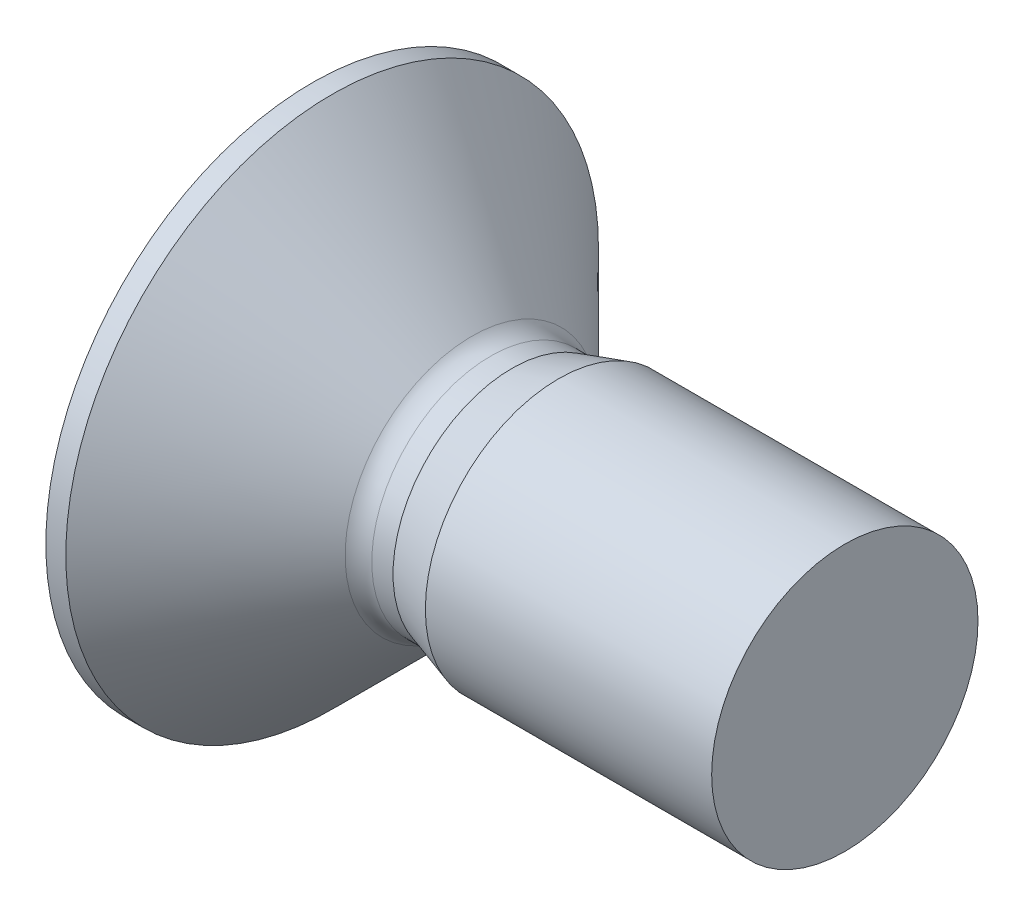
ISO-10303-21;
HEADER;
FILE_DESCRIPTION(('STEP AP214'),'2;1');
FILE_NAME('part.step','',(''),(''),'','','');
FILE_SCHEMA(('AUTOMOTIVE_DESIGN { 1 0 10303 214 1 1 1 1 }'));
ENDSEC;
DATA;
#1=APPLICATION_CONTEXT('core data for automotive mechanical design processes');
#2=APPLICATION_PROTOCOL_DEFINITION('international standard','automotive_design',2000,#1);
#3=PRODUCT_CONTEXT('',#1,'mechanical');
#4=PRODUCT('Part','Part','',(#3));
#5=PRODUCT_RELATED_PRODUCT_CATEGORY('part','',(#4));
#6=PRODUCT_DEFINITION_FORMATION('','',#4);
#7=PRODUCT_DEFINITION_CONTEXT('part definition',#1,'design');
#8=PRODUCT_DEFINITION('design','',#6,#7);
#9=PRODUCT_DEFINITION_SHAPE('','',#8);
#10=(LENGTH_UNIT() NAMED_UNIT(*) SI_UNIT(.MILLI.,.METRE.));
#11=(NAMED_UNIT(*) PLANE_ANGLE_UNIT() SI_UNIT($,.RADIAN.));
#12=(NAMED_UNIT(*) SI_UNIT($,.STERADIAN.) SOLID_ANGLE_UNIT());
#13=UNCERTAINTY_MEASURE_WITH_UNIT(LENGTH_MEASURE(1.E-05),#10,'distance_accuracy_value','');
#14=(GEOMETRIC_REPRESENTATION_CONTEXT(3) GLOBAL_UNCERTAINTY_ASSIGNED_CONTEXT((#13)) GLOBAL_UNIT_ASSIGNED_CONTEXT((#10,
#11,#12)) REPRESENTATION_CONTEXT('',''));
#15=CARTESIAN_POINT('',(0.,0.,0.));
#16=DIRECTION('',(0.,0.,1.));
#17=DIRECTION('',(1.,0.,0.));
#18=AXIS2_PLACEMENT_3D('',#15,#16,#17);
#19=CARTESIAN_POINT('',(-1.15,-1.33333333333333,1.33333333333333));
#20=DIRECTION('',(1.,0.,0.));
#21=DIRECTION('',(0.,1.,0.));
#22=AXIS2_PLACEMENT_3D('',#19,#20,#21);
#23=PLANE('',#22);
#24=DIRECTION('',(0.,-1.,0.));
#25=VECTOR('',#24,1.);
#26=CARTESIAN_POINT('',(-1.15,0.533333333333333,2.25));
#27=LINE('',#26,#25);
#28=CARTESIAN_POINT('',(-1.15,0.533333333333333,2.25));
#29=VERTEX_POINT('',#28);
#30=CARTESIAN_POINT('',(-1.15,-0.533333333333334,2.25));
#31=VERTEX_POINT('',#30);
#32=EDGE_CURVE('E212',#29,#31,#27,.T.);
#33=ORIENTED_EDGE('',*,*,#32,.F.);
#34=DIRECTION('',(0.,0.,1.));
#35=VECTOR('',#34,1.);
#36=CARTESIAN_POINT('',(-1.15,0.533333333333333,1.33333333333333));
#37=LINE('',#36,#35);
#38=CARTESIAN_POINT('',(-1.15,0.533333333333333,1.33333333333333));
#39=VERTEX_POINT('',#38);
#40=EDGE_CURVE('E10',#39,#29,#37,.T.);
#41=ORIENTED_EDGE('',*,*,#40,.F.);
#42=CARTESIAN_POINT('',(-1.15,1.33333333333333,1.33333333333333));
#43=DIRECTION('',(1.,0.,0.));
#44=DIRECTION('',(0.,0.,-1.));
#45=AXIS2_PLACEMENT_3D('',#42,#43,#44);
#46=CIRCLE('',#45,0.8);
#47=CARTESIAN_POINT('',(-1.15,1.33333333333333,0.533333333333332));
#48=VERTEX_POINT('',#47);
#49=EDGE_CURVE('E41',#39,#48,#46,.T.);
#50=ORIENTED_EDGE('',*,*,#49,.T.);
#51=DIRECTION('',(0.,-1.,0.));
#52=VECTOR('',#51,1.);
#53=CARTESIAN_POINT('',(-1.15,2.25,0.533333333333332));
#54=LINE('',#53,#52);
#55=CARTESIAN_POINT('',(-1.15,2.25,0.533333333333332));
#56=VERTEX_POINT('',#55);
#57=EDGE_CURVE('E295',#56,#48,#54,.T.);
#58=ORIENTED_EDGE('',*,*,#57,.F.);
#59=DIRECTION('',(0.,0.,1.));
#60=VECTOR('',#59,1.);
#61=CARTESIAN_POINT('',(-1.15,2.25,-0.533333333333332));
#62=LINE('',#61,#60);
#63=CARTESIAN_POINT('',(-1.15,2.25,-0.533333333333332));
#64=VERTEX_POINT('',#63);
#65=EDGE_CURVE('E259',#64,#56,#62,.T.);
#66=ORIENTED_EDGE('',*,*,#65,.F.);
#67=DIRECTION('',(0.,1.,0.));
#68=VECTOR('',#67,1.);
#69=CARTESIAN_POINT('',(-1.15,1.33333333333333,-0.533333333333332));
#70=LINE('',#69,#68);
#71=CARTESIAN_POINT('',(-1.15,1.33333333333333,-0.533333333333331));
#72=VERTEX_POINT('',#71);
#73=EDGE_CURVE('E287',#72,#64,#70,.T.);
#74=ORIENTED_EDGE('',*,*,#73,.F.);
#75=CARTESIAN_POINT('',(-1.15,1.33333333333333,-1.33333333333333));
#76=DIRECTION('',(1.,0.,0.));
#77=DIRECTION('',(0.,0.,-1.));
#78=AXIS2_PLACEMENT_3D('',#75,#76,#77);
#79=CIRCLE('',#78,0.8);
#80=CARTESIAN_POINT('',(-1.15,0.533333333333333,-1.33333333333333));
#81=VERTEX_POINT('',#80);
#82=EDGE_CURVE('E281',#72,#81,#79,.T.);
#83=ORIENTED_EDGE('',*,*,#82,.T.);
#84=DIRECTION('',(0.,0.,1.));
#85=VECTOR('',#84,1.);
#86=CARTESIAN_POINT('',(-1.15,0.533333333333333,-2.25));
#87=LINE('',#86,#85);
#88=CARTESIAN_POINT('',(-1.15,0.533333333333333,-2.25));
#89=VERTEX_POINT('',#88);
#90=EDGE_CURVE('E274',#89,#81,#87,.T.);
#91=ORIENTED_EDGE('',*,*,#90,.F.);
#92=DIRECTION('',(0.,1.,0.));
#93=VECTOR('',#92,1.);
#94=CARTESIAN_POINT('',(-1.15,-0.533333333333333,-2.25));
#95=LINE('',#94,#93);
#96=CARTESIAN_POINT('',(-1.15,-0.533333333333333,-2.25));
#97=VERTEX_POINT('',#96);
#98=EDGE_CURVE('E216',#97,#89,#95,.T.);
#99=ORIENTED_EDGE('',*,*,#98,.F.);
#100=DIRECTION('',(0.,0.,-1.));
#101=VECTOR('',#100,1.);
#102=CARTESIAN_POINT('',(-1.15,-0.533333333333333,-1.33333333333333));
#103=LINE('',#102,#101);
#104=CARTESIAN_POINT('',(-1.15,-0.533333333333333,-1.33333333333333));
#105=VERTEX_POINT('',#104);
#106=EDGE_CURVE('E217',#105,#97,#103,.T.);
#107=ORIENTED_EDGE('',*,*,#106,.F.);
#108=CARTESIAN_POINT('',(-1.15,-1.33333333333333,-1.33333333333333));
#109=DIRECTION('',(1.,0.,0.));
#110=DIRECTION('',(0.,0.,-1.));
#111=AXIS2_PLACEMENT_3D('',#108,#109,#110);
#112=CIRCLE('',#111,0.8);
#113=CARTESIAN_POINT('',(-1.15,-1.33333333333333,-0.533333333333332));
#114=VERTEX_POINT('',#113);
#115=EDGE_CURVE('E237',#105,#114,#112,.T.);
#116=ORIENTED_EDGE('',*,*,#115,.T.);
#117=DIRECTION('',(0.,1.,0.));
#118=VECTOR('',#117,1.);
#119=CARTESIAN_POINT('',(-1.15,-2.25,-0.533333333333332));
#120=LINE('',#119,#118);
#121=CARTESIAN_POINT('',(-1.15,-2.25,-0.533333333333332));
#122=VERTEX_POINT('',#121);
#123=EDGE_CURVE('E238',#122,#114,#120,.T.);
#124=ORIENTED_EDGE('',*,*,#123,.F.);
#125=DIRECTION('',(0.,0.,-1.));
#126=VECTOR('',#125,1.);
#127=CARTESIAN_POINT('',(-1.15,-2.25,0.533333333333333));
#128=LINE('',#127,#126);
#129=CARTESIAN_POINT('',(-1.15,-2.25,0.533333333333333));
#130=VERTEX_POINT('',#129);
#131=EDGE_CURVE('E225',#130,#122,#128,.T.);
#132=ORIENTED_EDGE('',*,*,#131,.F.);
#133=DIRECTION('',(0.,-1.,0.));
#134=VECTOR('',#133,1.);
#135=CARTESIAN_POINT('',(-1.15,-1.33333333333333,0.533333333333333));
#136=LINE('',#135,#134);
#137=CARTESIAN_POINT('',(-1.15,-1.33333333333333,0.533333333333333));
#138=VERTEX_POINT('',#137);
#139=EDGE_CURVE('E226',#138,#130,#136,.T.);
#140=ORIENTED_EDGE('',*,*,#139,.F.);
#141=CARTESIAN_POINT('',(-1.15,-1.33333333333333,1.33333333333333));
#142=DIRECTION('',(1.,0.,0.));
#143=DIRECTION('',(0.,0.,-1.));
#144=AXIS2_PLACEMENT_3D('',#141,#142,#143);
#145=CIRCLE('',#144,0.8);
#146=CARTESIAN_POINT('',(-1.15,-0.533333333333333,1.33333333333333));
#147=VERTEX_POINT('',#146);
#148=EDGE_CURVE('E239',#138,#147,#145,.T.);
#149=ORIENTED_EDGE('',*,*,#148,.T.);
#150=DIRECTION('',(0.,0.,-1.));
#151=VECTOR('',#150,1.);
#152=CARTESIAN_POINT('',(-1.15,-0.533333333333334,2.25));
#153=LINE('',#152,#151);
#154=EDGE_CURVE('E229',#31,#147,#153,.T.);
#155=ORIENTED_EDGE('',*,*,#154,.F.);
#156=EDGE_LOOP('',(#33,#41,#50,#58,#66,#74,#83,#91,#99,#107,#116,#124,#132,#140,#149,#155));
#157=FACE_BOUND('',#156,.T.);
#158=ADVANCED_FACE('F16',(#157),#23,.F.);
#159=CARTESIAN_POINT('',(-1.15,0.533333333333333,1.33333333333333));
#160=DIRECTION('',(0.,-1.,0.));
#161=DIRECTION('',(-1.,0.,0.));
#162=AXIS2_PLACEMENT_3D('',#159,#160,#161);
#163=PLANE('',#162);
#164=DIRECTION('',(0.,0.,1.));
#165=VECTOR('',#164,1.);
#166=CARTESIAN_POINT('',(-2.3,0.533333333333333,1.33333333333333));
#167=LINE('',#166,#165);
#168=CARTESIAN_POINT('',(-2.3,0.533333333333333,1.33333333333333));
#169=VERTEX_POINT('',#168);
#170=CARTESIAN_POINT('',(-2.3,0.533333333333333,2.25));
#171=VERTEX_POINT('',#170);
#172=EDGE_CURVE('E321',#169,#171,#167,.T.);
#173=ORIENTED_EDGE('',*,*,#172,.F.);
#174=DIRECTION('',(-1.,0.,0.));
#175=VECTOR('',#174,1.);
#176=CARTESIAN_POINT('',(-1.15,0.533333333333333,1.33333333333333));
#177=LINE('',#176,#175);
#178=EDGE_CURVE('E24',#39,#169,#177,.T.);
#179=ORIENTED_EDGE('',*,*,#178,.F.);
#180=ORIENTED_EDGE('',*,*,#40,.T.);
#181=DIRECTION('',(-1.,0.,0.));
#182=VECTOR('',#181,1.);
#183=CARTESIAN_POINT('',(-1.15,0.533333333333333,2.25));
#184=LINE('',#183,#182);
#185=EDGE_CURVE('E204',#29,#171,#184,.T.);
#186=ORIENTED_EDGE('',*,*,#185,.T.);
#187=EDGE_LOOP('',(#173,#179,#180,#186));
#188=FACE_BOUND('',#187,.T.);
#189=ADVANCED_FACE('F361',(#188),#163,.T.);
#190=CARTESIAN_POINT('',(-1.15,1.33333333333333,1.33333333333333));
#191=DIRECTION('',(-1.,0.,0.));
#192=DIRECTION('',(0.,0.,1.));
#193=AXIS2_PLACEMENT_3D('',#190,#191,#192);
#194=CYLINDRICAL_SURFACE('',#193,0.8);
#195=CARTESIAN_POINT('',(-2.3,1.33333333333333,1.33333333333333));
#196=DIRECTION('',(1.,0.,0.));
#197=DIRECTION('',(0.,0.,-1.));
#198=AXIS2_PLACEMENT_3D('',#195,#196,#197);
#199=CIRCLE('',#198,0.8);
#200=CARTESIAN_POINT('',(-2.3,1.33333333333333,0.533333333333332));
#201=VERTEX_POINT('',#200);
#202=EDGE_CURVE('E319',#169,#201,#199,.T.);
#203=ORIENTED_EDGE('',*,*,#202,.T.);
#204=DIRECTION('',(-1.,0.,0.));
#205=VECTOR('',#204,1.);
#206=CARTESIAN_POINT('',(-1.15,1.33333333333333,0.533333333333332));
#207=LINE('',#206,#205);
#208=EDGE_CURVE('E296',#48,#201,#207,.T.);
#209=ORIENTED_EDGE('',*,*,#208,.F.);
#210=ORIENTED_EDGE('',*,*,#49,.F.);
#211=ORIENTED_EDGE('',*,*,#178,.T.);
#212=EDGE_LOOP('',(#203,#209,#210,#211));
#213=FACE_BOUND('',#212,.T.);
#214=ADVANCED_FACE('F365',(#213),#194,.T.);
#215=CARTESIAN_POINT('',(-1.15,2.25,0.533333333333332));
#216=DIRECTION('',(0.,0.,-1.));
#217=DIRECTION('',(-1.,0.,0.));
#218=AXIS2_PLACEMENT_3D('',#215,#216,#217);
#219=PLANE('',#218);
#220=DIRECTION('',(0.,-1.,0.));
#221=VECTOR('',#220,1.);
#222=CARTESIAN_POINT('',(-2.3,2.25,0.533333333333332));
#223=LINE('',#222,#221);
#224=CARTESIAN_POINT('',(-2.3,2.25,0.533333333333332));
#225=VERTEX_POINT('',#224);
#226=EDGE_CURVE('E315',#225,#201,#223,.T.);
#227=ORIENTED_EDGE('',*,*,#226,.F.);
#228=DIRECTION('',(-1.,0.,0.));
#229=VECTOR('',#228,1.);
#230=CARTESIAN_POINT('',(-1.15,2.25,0.533333333333332));
#231=LINE('',#230,#229);
#232=EDGE_CURVE('E263',#56,#225,#231,.T.);
#233=ORIENTED_EDGE('',*,*,#232,.F.);
#234=ORIENTED_EDGE('',*,*,#57,.T.);
#235=ORIENTED_EDGE('',*,*,#208,.T.);
#236=EDGE_LOOP('',(#227,#233,#234,#235));
#237=FACE_BOUND('',#236,.T.);
#238=ADVANCED_FACE('F378',(#237),#219,.T.);
#239=CARTESIAN_POINT('',(-1.15,2.25,-0.533333333333332));
#240=DIRECTION('',(0.,-1.,0.));
#241=DIRECTION('',(0.,0.,-1.));
#242=AXIS2_PLACEMENT_3D('',#239,#240,#241);
#243=PLANE('',#242);
#244=DIRECTION('',(0.,0.,-1.));
#245=VECTOR('',#244,1.);
#246=CARTESIAN_POINT('',(-2.3,2.25,0.));
#247=LINE('',#246,#245);
#248=CARTESIAN_POINT('',(-2.3,2.25,-0.533333333333332));
#249=VERTEX_POINT('',#248);
#250=EDGE_CURVE('E320',#225,#249,#247,.T.);
#251=ORIENTED_EDGE('',*,*,#250,.T.);
#252=DIRECTION('',(-1.,0.,0.));
#253=VECTOR('',#252,1.);
#254=CARTESIAN_POINT('',(-1.15,2.25,-0.533333333333332));
#255=LINE('',#254,#253);
#256=EDGE_CURVE('E264',#64,#249,#255,.T.);
#257=ORIENTED_EDGE('',*,*,#256,.F.);
#258=ORIENTED_EDGE('',*,*,#65,.T.);
#259=ORIENTED_EDGE('',*,*,#232,.T.);
#260=EDGE_LOOP('',(#251,#257,#258,#259));
#261=FACE_BOUND('',#260,.T.);
#262=ADVANCED_FACE('F441',(#261),#243,.T.);
#263=CARTESIAN_POINT('',(-1.15,1.33333333333333,-0.533333333333332));
#264=DIRECTION('',(0.,0.,1.));
#265=DIRECTION('',(0.,-1.,0.));
#266=AXIS2_PLACEMENT_3D('',#263,#264,#265);
#267=PLANE('',#266);
#268=DIRECTION('',(0.,1.,0.));
#269=VECTOR('',#268,1.);
#270=CARTESIAN_POINT('',(-2.3,1.33333333333333,-0.533333333333332));
#271=LINE('',#270,#269);
#272=CARTESIAN_POINT('',(-2.3,1.33333333333333,-0.533333333333331));
#273=VERTEX_POINT('',#272);
#274=EDGE_CURVE('E310',#273,#249,#271,.T.);
#275=ORIENTED_EDGE('',*,*,#274,.F.);
#276=DIRECTION('',(-1.,0.,0.));
#277=VECTOR('',#276,1.);
#278=CARTESIAN_POINT('',(-1.15,1.33333333333333,-0.533333333333331));
#279=LINE('',#278,#277);
#280=EDGE_CURVE('E284',#72,#273,#279,.T.);
#281=ORIENTED_EDGE('',*,*,#280,.F.);
#282=ORIENTED_EDGE('',*,*,#73,.T.);
#283=ORIENTED_EDGE('',*,*,#256,.T.);
#284=EDGE_LOOP('',(#275,#281,#282,#283));
#285=FACE_BOUND('',#284,.T.);
#286=ADVANCED_FACE('F439',(#285),#267,.T.);
#287=CARTESIAN_POINT('',(-1.15,1.33333333333333,-1.33333333333333));
#288=DIRECTION('',(-1.,0.,0.));
#289=DIRECTION('',(0.,0.,1.));
#290=AXIS2_PLACEMENT_3D('',#287,#288,#289);
#291=CYLINDRICAL_SURFACE('',#290,0.8);
#292=CARTESIAN_POINT('',(-2.3,1.33333333333333,-1.33333333333333));
#293=DIRECTION('',(1.,0.,0.));
#294=DIRECTION('',(0.,0.,-1.));
#295=AXIS2_PLACEMENT_3D('',#292,#293,#294);
#296=CIRCLE('',#295,0.8);
#297=CARTESIAN_POINT('',(-2.3,0.533333333333333,-1.33333333333333));
#298=VERTEX_POINT('',#297);
#299=EDGE_CURVE('E414',#273,#298,#296,.T.);
#300=ORIENTED_EDGE('',*,*,#299,.T.);
#301=DIRECTION('',(-1.,0.,0.));
#302=VECTOR('',#301,1.);
#303=CARTESIAN_POINT('',(-1.15,0.533333333333333,-1.33333333333333));
#304=LINE('',#303,#302);
#305=EDGE_CURVE('E278',#81,#298,#304,.T.);
#306=ORIENTED_EDGE('',*,*,#305,.F.);
#307=ORIENTED_EDGE('',*,*,#82,.F.);
#308=ORIENTED_EDGE('',*,*,#280,.T.);
#309=EDGE_LOOP('',(#300,#306,#307,#308));
#310=FACE_BOUND('',#309,.T.);
#311=ADVANCED_FACE('F445',(#310),#291,.T.);
#312=CARTESIAN_POINT('',(-1.15,0.533333333333333,-2.25));
#313=DIRECTION('',(0.,-1.,0.));
#314=DIRECTION('',(-1.,0.,0.));
#315=AXIS2_PLACEMENT_3D('',#312,#313,#314);
#316=PLANE('',#315);
#317=DIRECTION('',(0.,0.,1.));
#318=VECTOR('',#317,1.);
#319=CARTESIAN_POINT('',(-2.3,0.533333333333333,-2.25));
#320=LINE('',#319,#318);
#321=CARTESIAN_POINT('',(-2.3,0.533333333333333,-2.25));
#322=VERTEX_POINT('',#321);
#323=EDGE_CURVE('E410',#322,#298,#320,.T.);
#324=ORIENTED_EDGE('',*,*,#323,.F.);
#325=DIRECTION('',(-1.,0.,0.));
#326=VECTOR('',#325,1.);
#327=CARTESIAN_POINT('',(-1.15,0.533333333333333,-2.25));
#328=LINE('',#327,#326);
#329=EDGE_CURVE('E271',#89,#322,#328,.T.);
#330=ORIENTED_EDGE('',*,*,#329,.F.);
#331=ORIENTED_EDGE('',*,*,#90,.T.);
#332=ORIENTED_EDGE('',*,*,#305,.T.);
#333=EDGE_LOOP('',(#324,#330,#331,#332));
#334=FACE_BOUND('',#333,.T.);
#335=ADVANCED_FACE('F448',(#334),#316,.T.);
#336=CARTESIAN_POINT('',(-1.15,-0.533333333333333,-2.25));
#337=DIRECTION('',(0.,0.,1.));
#338=DIRECTION('',(1.,0.,0.));
#339=AXIS2_PLACEMENT_3D('',#336,#337,#338);
#340=PLANE('',#339);
#341=DIRECTION('',(0.,1.,0.));
#342=VECTOR('',#341,1.);
#343=CARTESIAN_POINT('',(-2.3,-0.533333333333333,-2.25));
#344=LINE('',#343,#342);
#345=CARTESIAN_POINT('',(-2.3,-0.533333333333333,-2.25));
#346=VERTEX_POINT('',#345);
#347=EDGE_CURVE('E407',#346,#322,#344,.T.);
#348=ORIENTED_EDGE('',*,*,#347,.F.);
#349=DIRECTION('',(-1.,0.,0.));
#350=VECTOR('',#349,1.);
#351=CARTESIAN_POINT('',(-1.15,-0.533333333333333,-2.25));
#352=LINE('',#351,#350);
#353=EDGE_CURVE('E213',#97,#346,#352,.T.);
#354=ORIENTED_EDGE('',*,*,#353,.F.);
#355=ORIENTED_EDGE('',*,*,#98,.T.);
#356=ORIENTED_EDGE('',*,*,#329,.T.);
#357=EDGE_LOOP('',(#348,#354,#355,#356));
#358=FACE_BOUND('',#357,.T.);
#359=ADVANCED_FACE('F452',(#358),#340,.T.);
#360=CARTESIAN_POINT('',(-1.15,-0.533333333333333,-1.33333333333333));
#361=DIRECTION('',(0.,1.,0.));
#362=DIRECTION('',(0.,0.,-1.));
#363=AXIS2_PLACEMENT_3D('',#360,#361,#362);
#364=PLANE('',#363);
#365=DIRECTION('',(0.,0.,-1.));
#366=VECTOR('',#365,1.);
#367=CARTESIAN_POINT('',(-2.3,-0.533333333333333,-1.33333333333333));
#368=LINE('',#367,#366);
#369=CARTESIAN_POINT('',(-2.3,-0.533333333333333,-1.33333333333333));
#370=VERTEX_POINT('',#369);
#371=EDGE_CURVE('E395',#370,#346,#368,.T.);
#372=ORIENTED_EDGE('',*,*,#371,.F.);
#373=DIRECTION('',(-1.,0.,0.));
#374=VECTOR('',#373,1.);
#375=CARTESIAN_POINT('',(-1.15,-0.533333333333333,-1.33333333333333));
#376=LINE('',#375,#374);
#377=EDGE_CURVE('E256',#105,#370,#376,.T.);
#378=ORIENTED_EDGE('',*,*,#377,.F.);
#379=ORIENTED_EDGE('',*,*,#106,.T.);
#380=ORIENTED_EDGE('',*,*,#353,.T.);
#381=EDGE_LOOP('',(#372,#378,#379,#380));
#382=FACE_BOUND('',#381,.T.);
#383=ADVANCED_FACE('F458',(#382),#364,.T.);
#384=CARTESIAN_POINT('',(-1.15,-1.33333333333333,-1.33333333333333));
#385=DIRECTION('',(-1.,0.,0.));
#386=DIRECTION('',(0.,0.,1.));
#387=AXIS2_PLACEMENT_3D('',#384,#385,#386);
#388=CYLINDRICAL_SURFACE('',#387,0.8);
#389=CARTESIAN_POINT('',(-2.3,-1.33333333333333,-1.33333333333333));
#390=DIRECTION('',(1.,0.,0.));
#391=DIRECTION('',(0.,0.,-1.));
#392=AXIS2_PLACEMENT_3D('',#389,#390,#391);
#393=CIRCLE('',#392,0.8);
#394=CARTESIAN_POINT('',(-2.3,-1.33333333333333,-0.533333333333332));
#395=VERTEX_POINT('',#394);
#396=EDGE_CURVE('E391',#370,#395,#393,.T.);
#397=ORIENTED_EDGE('',*,*,#396,.T.);
#398=DIRECTION('',(-1.,0.,0.));
#399=VECTOR('',#398,1.);
#400=CARTESIAN_POINT('',(-1.15,-1.33333333333333,-0.533333333333332));
#401=LINE('',#400,#399);
#402=EDGE_CURVE('E234',#114,#395,#401,.T.);
#403=ORIENTED_EDGE('',*,*,#402,.F.);
#404=ORIENTED_EDGE('',*,*,#115,.F.);
#405=ORIENTED_EDGE('',*,*,#377,.T.);
#406=EDGE_LOOP('',(#397,#403,#404,#405));
#407=FACE_BOUND('',#406,.T.);
#408=ADVANCED_FACE('F461',(#407),#388,.T.);
#409=CARTESIAN_POINT('',(-1.15,-2.25,-0.533333333333332));
#410=DIRECTION('',(0.,0.,1.));
#411=DIRECTION('',(0.,-1.,0.));
#412=AXIS2_PLACEMENT_3D('',#409,#410,#411);
#413=PLANE('',#412);
#414=DIRECTION('',(0.,1.,0.));
#415=VECTOR('',#414,1.);
#416=CARTESIAN_POINT('',(-2.3,-2.25,-0.533333333333332));
#417=LINE('',#416,#415);
#418=CARTESIAN_POINT('',(-2.3,-2.25,-0.533333333333332));
#419=VERTEX_POINT('',#418);
#420=EDGE_CURVE('E396',#419,#395,#417,.T.);
#421=ORIENTED_EDGE('',*,*,#420,.F.);
#422=DIRECTION('',(-1.,0.,0.));
#423=VECTOR('',#422,1.);
#424=CARTESIAN_POINT('',(-1.15,-2.25,-0.533333333333332));
#425=LINE('',#424,#423);
#426=EDGE_CURVE('E248',#122,#419,#425,.T.);
#427=ORIENTED_EDGE('',*,*,#426,.F.);
#428=ORIENTED_EDGE('',*,*,#123,.T.);
#429=ORIENTED_EDGE('',*,*,#402,.T.);
#430=EDGE_LOOP('',(#421,#427,#428,#429));
#431=FACE_BOUND('',#430,.T.);
#432=ADVANCED_FACE('F465',(#431),#413,.T.);
#433=CARTESIAN_POINT('',(-1.15,-2.25,0.533333333333333));
#434=DIRECTION('',(0.,1.,0.));
#435=DIRECTION('',(1.,0.,0.));
#436=AXIS2_PLACEMENT_3D('',#433,#434,#435);
#437=PLANE('',#436);
#438=DIRECTION('',(0.,0.,-1.));
#439=VECTOR('',#438,1.);
#440=CARTESIAN_POINT('',(-2.3,-2.25,0.533333333333333));
#441=LINE('',#440,#439);
#442=CARTESIAN_POINT('',(-2.3,-2.25,0.533333333333333));
#443=VERTEX_POINT('',#442);
#444=EDGE_CURVE('E397',#443,#419,#441,.T.);
#445=ORIENTED_EDGE('',*,*,#444,.F.);
#446=DIRECTION('',(-1.,0.,0.));
#447=VECTOR('',#446,1.);
#448=CARTESIAN_POINT('',(-1.15,-2.25,0.533333333333333));
#449=LINE('',#448,#447);
#450=EDGE_CURVE('E222',#130,#443,#449,.T.);
#451=ORIENTED_EDGE('',*,*,#450,.F.);
#452=ORIENTED_EDGE('',*,*,#131,.T.);
#453=ORIENTED_EDGE('',*,*,#426,.T.);
#454=EDGE_LOOP('',(#445,#451,#452,#453));
#455=FACE_BOUND('',#454,.T.);
#456=ADVANCED_FACE('F470',(#455),#437,.T.);
#457=CARTESIAN_POINT('',(-1.15,-1.33333333333333,0.533333333333333));
#458=DIRECTION('',(0.,0.,-1.));
#459=DIRECTION('',(0.,-1.,0.));
#460=AXIS2_PLACEMENT_3D('',#457,#458,#459);
#461=PLANE('',#460);
#462=DIRECTION('',(0.,-1.,0.));
#463=VECTOR('',#462,1.);
#464=CARTESIAN_POINT('',(-2.3,-1.33333333333333,0.533333333333333));
#465=LINE('',#464,#463);
#466=CARTESIAN_POINT('',(-2.3,-1.33333333333333,0.533333333333333));
#467=VERTEX_POINT('',#466);
#468=EDGE_CURVE('E385',#467,#443,#465,.T.);
#469=ORIENTED_EDGE('',*,*,#468,.F.);
#470=DIRECTION('',(-1.,0.,0.));
#471=VECTOR('',#470,1.);
#472=CARTESIAN_POINT('',(-1.15,-1.33333333333333,0.533333333333333));
#473=LINE('',#472,#471);
#474=EDGE_CURVE('E242',#138,#467,#473,.T.);
#475=ORIENTED_EDGE('',*,*,#474,.F.);
#476=ORIENTED_EDGE('',*,*,#139,.T.);
#477=ORIENTED_EDGE('',*,*,#450,.T.);
#478=EDGE_LOOP('',(#469,#475,#476,#477));
#479=FACE_BOUND('',#478,.T.);
#480=ADVANCED_FACE('F474',(#479),#461,.T.);
#481=CARTESIAN_POINT('',(-1.15,-1.33333333333333,1.33333333333333));
#482=DIRECTION('',(-1.,0.,0.));
#483=DIRECTION('',(0.,0.,1.));
#484=AXIS2_PLACEMENT_3D('',#481,#482,#483);
#485=CYLINDRICAL_SURFACE('',#484,0.8);
#486=CARTESIAN_POINT('',(-2.3,-1.33333333333333,1.33333333333333));
#487=DIRECTION('',(1.,0.,0.));
#488=DIRECTION('',(0.,0.,-1.));
#489=AXIS2_PLACEMENT_3D('',#486,#487,#488);
#490=CIRCLE('',#489,0.8);
#491=CARTESIAN_POINT('',(-2.3,-0.533333333333333,1.33333333333333));
#492=VERTEX_POINT('',#491);
#493=EDGE_CURVE('E386',#467,#492,#490,.T.);
#494=ORIENTED_EDGE('',*,*,#493,.T.);
#495=DIRECTION('',(-1.,0.,0.));
#496=VECTOR('',#495,1.);
#497=CARTESIAN_POINT('',(-1.15,-0.533333333333333,1.33333333333333));
#498=LINE('',#497,#496);
#499=EDGE_CURVE('E233',#147,#492,#498,.T.);
#500=ORIENTED_EDGE('',*,*,#499,.F.);
#501=ORIENTED_EDGE('',*,*,#148,.F.);
#502=ORIENTED_EDGE('',*,*,#474,.T.);
#503=EDGE_LOOP('',(#494,#500,#501,#502));
#504=FACE_BOUND('',#503,.T.);
#505=ADVANCED_FACE('F479',(#504),#485,.T.);
#506=CARTESIAN_POINT('',(-1.15,-0.533333333333334,2.25));
#507=DIRECTION('',(0.,1.,0.));
#508=DIRECTION('',(0.,0.,-1.));
#509=AXIS2_PLACEMENT_3D('',#506,#507,#508);
#510=PLANE('',#509);
#511=DIRECTION('',(0.,0.,-1.));
#512=VECTOR('',#511,1.);
#513=CARTESIAN_POINT('',(-2.3,-0.533333333333334,2.25));
#514=LINE('',#513,#512);
#515=CARTESIAN_POINT('',(-2.3,-0.533333333333334,2.25));
#516=VERTEX_POINT('',#515);
#517=EDGE_CURVE('E390',#516,#492,#514,.T.);
#518=ORIENTED_EDGE('',*,*,#517,.F.);
#519=DIRECTION('',(-1.,0.,0.));
#520=VECTOR('',#519,1.);
#521=CARTESIAN_POINT('',(-1.15,-0.533333333333334,2.25));
#522=LINE('',#521,#520);
#523=EDGE_CURVE('E221',#31,#516,#522,.T.);
#524=ORIENTED_EDGE('',*,*,#523,.F.);
#525=ORIENTED_EDGE('',*,*,#154,.T.);
#526=ORIENTED_EDGE('',*,*,#499,.T.);
#527=EDGE_LOOP('',(#518,#524,#525,#526));
#528=FACE_BOUND('',#527,.T.);
#529=ADVANCED_FACE('F482',(#528),#510,.T.);
#530=CARTESIAN_POINT('',(-1.15,0.533333333333333,2.25));
#531=DIRECTION('',(0.,0.,-1.));
#532=DIRECTION('',(0.,-1.,0.));
#533=AXIS2_PLACEMENT_3D('',#530,#531,#532);
#534=PLANE('',#533);
#535=DIRECTION('',(0.,-1.,0.));
#536=VECTOR('',#535,1.);
#537=CARTESIAN_POINT('',(-2.3,0.533333333333333,2.25));
#538=LINE('',#537,#536);
#539=EDGE_CURVE('E325',#171,#516,#538,.T.);
#540=ORIENTED_EDGE('',*,*,#539,.F.);
#541=ORIENTED_EDGE('',*,*,#185,.F.);
#542=ORIENTED_EDGE('',*,*,#32,.T.);
#543=ORIENTED_EDGE('',*,*,#523,.T.);
#544=EDGE_LOOP('',(#540,#541,#542,#543));
#545=FACE_BOUND('',#544,.T.);
#546=ADVANCED_FACE('F372',(#545),#534,.T.);
#547=CARTESIAN_POINT('',(5.7,2.,0.));
#548=DIRECTION('',(-1.,0.,0.));
#549=DIRECTION('',(0.,0.,1.));
#550=AXIS2_PLACEMENT_3D('',#547,#548,#549);
#551=PLANE('',#550);
#552=CARTESIAN_POINT('',(5.7,0.,0.));
#553=DIRECTION('',(1.,0.,0.));
#554=DIRECTION('',(0.,0.,-1.));
#555=AXIS2_PLACEMENT_3D('',#552,#553,#554);
#556=CIRCLE('',#555,2.);
#557=CARTESIAN_POINT('',(5.7,0.,-2.));
#558=VERTEX_POINT('',#557);
#559=EDGE_CURVE('E196',#558,#558,#556,.T.);
#560=ORIENTED_EDGE('',*,*,#559,.T.);
#561=EDGE_LOOP('',(#560));
#562=FACE_BOUND('',#561,.T.);
#563=ADVANCED_FACE('F630',(#562),#551,.F.);
#564=CARTESIAN_POINT('',(5.7,0.,0.));
#565=DIRECTION('',(1.,0.,0.));
#566=DIRECTION('',(0.,0.,-1.));
#567=AXIS2_PLACEMENT_3D('',#564,#565,#566);
#568=CYLINDRICAL_SURFACE('',#567,2.);
#569=CARTESIAN_POINT('',(1.4,0.,0.));
#570=DIRECTION('',(1.,0.,0.));
#571=DIRECTION('',(0.,0.,-1.));
#572=AXIS2_PLACEMENT_3D('',#569,#570,#571);
#573=CIRCLE('',#572,2.);
#574=CARTESIAN_POINT('',(1.4,0.,-2.));
#575=VERTEX_POINT('',#574);
#576=EDGE_CURVE('E191',#575,#575,#573,.T.);
#577=ORIENTED_EDGE('',*,*,#576,.T.);
#578=EDGE_LOOP('',(#577));
#579=FACE_BOUND('',#578,.T.);
#580=ORIENTED_EDGE('',*,*,#559,.F.);
#581=EDGE_LOOP('',(#580));
#582=FACE_BOUND('',#581,.T.);
#583=ADVANCED_FACE('F192',(#579,#582),#568,.T.);
#584=CARTESIAN_POINT('',(0.7,0.,0.));
#585=DIRECTION('',(1.,0.,0.));
#586=DIRECTION('',(0.,0.,-1.));
#587=AXIS2_PLACEMENT_3D('',#584,#585,#586);
#588=CONICAL_SURFACE('',#587,1.78525,0.297670535350328);
#589=CARTESIAN_POINT('',(0.7,0.,0.));
#590=DIRECTION('',(1.,0.,0.));
#591=DIRECTION('',(0.,0.,-1.));
#592=AXIS2_PLACEMENT_3D('',#589,#590,#591);
#593=CIRCLE('',#592,1.78525);
#594=CARTESIAN_POINT('',(0.7,0.,-1.78525));
#595=VERTEX_POINT('',#594);
#596=EDGE_CURVE('E197',#595,#595,#593,.T.);
#597=ORIENTED_EDGE('',*,*,#596,.T.);
#598=EDGE_LOOP('',(#597));
#599=FACE_BOUND('',#598,.T.);
#600=ORIENTED_EDGE('',*,*,#576,.F.);
#601=EDGE_LOOP('',(#600));
#602=FACE_BOUND('',#601,.T.);
#603=ADVANCED_FACE('F357',(#599,#602),#588,.T.);
#604=CARTESIAN_POINT('',(5.7,0.,0.));
#605=DIRECTION('',(1.,0.,0.));
#606=DIRECTION('',(0.,0.,-1.));
#607=AXIS2_PLACEMENT_3D('',#604,#605,#606);
#608=CYLINDRICAL_SURFACE('',#607,1.78525);
#609=CARTESIAN_POINT('',(0.380435424949238,0.,0.));
#610=DIRECTION('',(1.,0.,0.));
#611=DIRECTION('',(0.,0.,-1.));
#612=AXIS2_PLACEMENT_3D('',#609,#610,#611);
#613=CIRCLE('',#612,1.78525);
#614=CARTESIAN_POINT('',(0.380435424949238,0.,-1.78525));
#615=VERTEX_POINT('',#614);
#616=EDGE_CURVE('E206',#615,#615,#613,.T.);
#617=ORIENTED_EDGE('',*,*,#616,.T.);
#618=EDGE_LOOP('',(#617));
#619=FACE_BOUND('',#618,.T.);
#620=ORIENTED_EDGE('',*,*,#596,.F.);
#621=EDGE_LOOP('',(#620));
#622=FACE_BOUND('',#621,.T.);
#623=ADVANCED_FACE('F341',(#619,#622),#608,.T.);
#624=CARTESIAN_POINT('',(0.380435424949238,0.,0.));
#625=DIRECTION('',(1.,0.,0.));
#626=DIRECTION('',(0.,0.,-1.));
#627=AXIS2_PLACEMENT_3D('',#624,#625,#626);
#628=TOROIDAL_SURFACE('',#627,2.18525,0.4);
#629=CARTESIAN_POINT('',(0.0975927124746197,0.,0.));
#630=DIRECTION('',(1.,0.,0.));
#631=DIRECTION('',(0.,0.,-1.));
#632=AXIS2_PLACEMENT_3D('',#629,#630,#631);
#633=CIRCLE('',#632,1.90240728752538);
#634=CARTESIAN_POINT('',(0.0975927124746197,0.,-1.90240728752538));
#635=VERTEX_POINT('',#634);
#636=EDGE_CURVE('E334',#635,#635,#633,.T.);
#637=ORIENTED_EDGE('',*,*,#636,.T.);
#638=EDGE_LOOP('',(#637));
#639=FACE_BOUND('',#638,.T.);
#640=ORIENTED_EDGE('',*,*,#616,.F.);
#641=EDGE_LOOP('',(#640));
#642=FACE_BOUND('',#641,.T.);
#643=ADVANCED_FACE('F344',(#639,#642),#628,.F.);
#644=CARTESIAN_POINT('',(-2.,0.,0.));
#645=DIRECTION('',(-1.,0.,0.));
#646=DIRECTION('',(0.,0.,1.));
#647=AXIS2_PLACEMENT_3D('',#644,#645,#646);
#648=CONICAL_SURFACE('',#647,4.,0.785398163397448);
#649=CARTESIAN_POINT('',(-2.,0.,0.));
#650=DIRECTION('',(1.,0.,0.));
#651=DIRECTION('',(0.,0.,-1.));
#652=AXIS2_PLACEMENT_3D('',#649,#650,#651);
#653=CIRCLE('',#652,4.);
#654=CARTESIAN_POINT('',(-2.,0.,-4.));
#655=VERTEX_POINT('',#654);
#656=EDGE_CURVE('E329',#655,#655,#653,.T.);
#657=ORIENTED_EDGE('',*,*,#656,.T.);
#658=EDGE_LOOP('',(#657));
#659=FACE_BOUND('',#658,.T.);
#660=ORIENTED_EDGE('',*,*,#636,.F.);
#661=EDGE_LOOP('',(#660));
#662=FACE_BOUND('',#661,.T.);
#663=ADVANCED_FACE('F346',(#659,#662),#648,.T.);
#664=CARTESIAN_POINT('',(5.7,0.,0.));
#665=DIRECTION('',(1.,0.,0.));
#666=DIRECTION('',(0.,0.,-1.));
#667=AXIS2_PLACEMENT_3D('',#664,#665,#666);
#668=CYLINDRICAL_SURFACE('',#667,4.);
#669=CARTESIAN_POINT('',(-2.3,0.,0.));
#670=DIRECTION('',(1.,0.,0.));
#671=DIRECTION('',(0.,0.,-1.));
#672=AXIS2_PLACEMENT_3D('',#669,#670,#671);
#673=CIRCLE('',#672,4.);
#674=CARTESIAN_POINT('',(-2.3,0.,-4.));
#675=VERTEX_POINT('',#674);
#676=EDGE_CURVE('E484',#675,#675,#673,.T.);
#677=ORIENTED_EDGE('',*,*,#676,.T.);
#678=EDGE_LOOP('',(#677));
#679=FACE_BOUND('',#678,.T.);
#680=ORIENTED_EDGE('',*,*,#656,.F.);
#681=EDGE_LOOP('',(#680));
#682=FACE_BOUND('',#681,.T.);
#683=ADVANCED_FACE('F354',(#679,#682),#668,.T.);
#684=CARTESIAN_POINT('',(-2.3,0.,0.));
#685=DIRECTION('',(1.,0.,0.));
#686=DIRECTION('',(0.,1.,0.));
#687=AXIS2_PLACEMENT_3D('',#684,#685,#686);
#688=PLANE('',#687);
#689=ORIENTED_EDGE('',*,*,#517,.T.);
#690=ORIENTED_EDGE('',*,*,#493,.F.);
#691=ORIENTED_EDGE('',*,*,#468,.T.);
#692=ORIENTED_EDGE('',*,*,#444,.T.);
#693=ORIENTED_EDGE('',*,*,#420,.T.);
#694=ORIENTED_EDGE('',*,*,#396,.F.);
#695=ORIENTED_EDGE('',*,*,#371,.T.);
#696=ORIENTED_EDGE('',*,*,#347,.T.);
#697=ORIENTED_EDGE('',*,*,#323,.T.);
#698=ORIENTED_EDGE('',*,*,#299,.F.);
#699=ORIENTED_EDGE('',*,*,#274,.T.);
#700=ORIENTED_EDGE('',*,*,#250,.F.);
#701=ORIENTED_EDGE('',*,*,#226,.T.);
#702=ORIENTED_EDGE('',*,*,#202,.F.);
#703=ORIENTED_EDGE('',*,*,#172,.T.);
#704=ORIENTED_EDGE('',*,*,#539,.T.);
#705=EDGE_LOOP('',(#689,#690,#691,#692,#693,#694,#695,#696,#697,#698,#699,#700,#701,#702,#703,#704));
#706=FACE_BOUND('',#705,.T.);
#707=ORIENTED_EDGE('',*,*,#676,.F.);
#708=EDGE_LOOP('',(#707));
#709=FACE_BOUND('',#708,.T.);
#710=ADVANCED_FACE('F435',(#706,#709),#688,.F.);
#711=CLOSED_SHELL('',(#158,#189,#214,#238,#262,#286,#311,#335,#359,#383,#408,#432,#456,#480,
#505,#529,#546,#563,#583,#603,#623,#643,#663,#683,#710));
#712=MANIFOLD_SOLID_BREP('B1',#711);
#713=ADVANCED_BREP_SHAPE_REPRESENTATION('',(#18,#712),#14);
#714=SHAPE_DEFINITION_REPRESENTATION(#9,#713);
ENDSEC;
END-ISO-10303-21;
